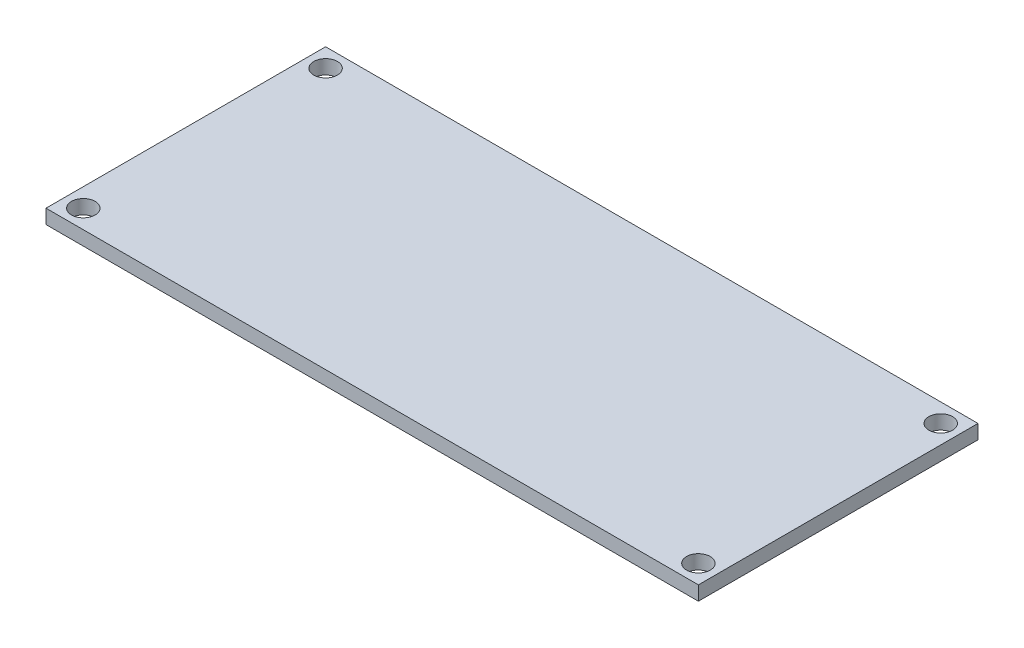
ISO-10303-21;
HEADER;
FILE_DESCRIPTION(('STEP AP214'),'2;1');
FILE_NAME('part.step','',(''),(''),'','','');
FILE_SCHEMA(('AUTOMOTIVE_DESIGN { 1 0 10303 214 1 1 1 1 }'));
ENDSEC;
DATA;
#1=APPLICATION_CONTEXT('core data for automotive mechanical design processes');
#2=APPLICATION_PROTOCOL_DEFINITION('international standard','automotive_design',2000,#1);
#3=PRODUCT_CONTEXT('',#1,'mechanical');
#4=PRODUCT('Part','Part','',(#3));
#5=PRODUCT_RELATED_PRODUCT_CATEGORY('part','',(#4));
#6=PRODUCT_DEFINITION_FORMATION('','',#4);
#7=PRODUCT_DEFINITION_CONTEXT('part definition',#1,'design');
#8=PRODUCT_DEFINITION('design','',#6,#7);
#9=PRODUCT_DEFINITION_SHAPE('','',#8);
#10=(LENGTH_UNIT() NAMED_UNIT(*) SI_UNIT(.MILLI.,.METRE.));
#11=(NAMED_UNIT(*) PLANE_ANGLE_UNIT() SI_UNIT($,.RADIAN.));
#12=(NAMED_UNIT(*) SI_UNIT($,.STERADIAN.) SOLID_ANGLE_UNIT());
#13=UNCERTAINTY_MEASURE_WITH_UNIT(LENGTH_MEASURE(1.E-05),#10,'distance_accuracy_value','');
#14=(GEOMETRIC_REPRESENTATION_CONTEXT(3) GLOBAL_UNCERTAINTY_ASSIGNED_CONTEXT((#13)) GLOBAL_UNIT_ASSIGNED_CONTEXT((#10,
#11,#12)) REPRESENTATION_CONTEXT('',''));
#15=CARTESIAN_POINT('',(0.,0.,0.));
#16=DIRECTION('',(0.,0.,1.));
#17=DIRECTION('',(1.,0.,0.));
#18=AXIS2_PLACEMENT_3D('',#15,#16,#17);
#19=CARTESIAN_POINT('',(-29.452380952381,1.524,-16.3095238095238));
#20=DIRECTION('',(1.,0.,0.));
#21=DIRECTION('',(0.,0.,-1.));
#22=AXIS2_PLACEMENT_3D('',#19,#20,#21);
#23=PLANE('',#22);
#24=DIRECTION('',(0.,0.,1.));
#25=VECTOR('',#24,1.);
#26=CARTESIAN_POINT('',(-29.452380952381,0.,-16.3095238095238));
#27=LINE('',#26,#25);
#28=CARTESIAN_POINT('',(-29.452380952381,0.,-16.3095238095238));
#29=VERTEX_POINT('',#28);
#30=CARTESIAN_POINT('',(-29.452380952381,0.,13.6904761904762));
#31=VERTEX_POINT('',#30);
#32=EDGE_CURVE('E95',#29,#31,#27,.T.);
#33=ORIENTED_EDGE('',*,*,#32,.T.);
#34=DIRECTION('',(0.,-1.,0.));
#35=VECTOR('',#34,1.);
#36=CARTESIAN_POINT('',(-29.452380952381,1.524,13.6904761904762));
#37=LINE('',#36,#35);
#38=CARTESIAN_POINT('',(-29.452380952381,1.524,13.6904761904762));
#39=VERTEX_POINT('',#38);
#40=EDGE_CURVE('E11',#39,#31,#37,.T.);
#41=ORIENTED_EDGE('',*,*,#40,.F.);
#42=DIRECTION('',(0.,0.,1.));
#43=VECTOR('',#42,1.);
#44=CARTESIAN_POINT('',(-29.452380952381,1.524,-16.3095238095238));
#45=LINE('',#44,#43);
#46=CARTESIAN_POINT('',(-29.452380952381,1.524,-16.3095238095238));
#47=VERTEX_POINT('',#46);
#48=EDGE_CURVE('E83',#47,#39,#45,.T.);
#49=ORIENTED_EDGE('',*,*,#48,.F.);
#50=DIRECTION('',(0.,-1.,0.));
#51=VECTOR('',#50,1.);
#52=CARTESIAN_POINT('',(-29.452380952381,1.524,-16.3095238095238));
#53=LINE('',#52,#51);
#54=EDGE_CURVE('E91',#47,#29,#53,.T.);
#55=ORIENTED_EDGE('',*,*,#54,.T.);
#56=EDGE_LOOP('',(#33,#41,#49,#55));
#57=FACE_BOUND('',#56,.T.);
#58=ADVANCED_FACE('F32',(#57),#23,.F.);
#59=CARTESIAN_POINT('',(-29.452380952381,1.524,13.6904761904762));
#60=DIRECTION('',(0.,0.,-1.));
#61=DIRECTION('',(-1.,0.,0.));
#62=AXIS2_PLACEMENT_3D('',#59,#60,#61);
#63=PLANE('',#62);
#64=DIRECTION('',(1.,0.,0.));
#65=VECTOR('',#64,1.);
#66=CARTESIAN_POINT('',(-29.452380952381,0.,13.6904761904762));
#67=LINE('',#66,#65);
#68=CARTESIAN_POINT('',(40.5476190476191,0.,13.6904761904762));
#69=VERTEX_POINT('',#68);
#70=EDGE_CURVE('E87',#31,#69,#67,.T.);
#71=ORIENTED_EDGE('',*,*,#70,.T.);
#72=DIRECTION('',(0.,-1.,0.));
#73=VECTOR('',#72,1.);
#74=CARTESIAN_POINT('',(40.5476190476191,1.524,13.6904761904762));
#75=LINE('',#74,#73);
#76=CARTESIAN_POINT('',(40.5476190476191,1.524,13.6904761904762));
#77=VERTEX_POINT('',#76);
#78=EDGE_CURVE('E40',#77,#69,#75,.T.);
#79=ORIENTED_EDGE('',*,*,#78,.F.);
#80=DIRECTION('',(1.,0.,0.));
#81=VECTOR('',#80,1.);
#82=CARTESIAN_POINT('',(-29.452380952381,1.524,13.6904761904762));
#83=LINE('',#82,#81);
#84=EDGE_CURVE('E78',#39,#77,#83,.T.);
#85=ORIENTED_EDGE('',*,*,#84,.F.);
#86=ORIENTED_EDGE('',*,*,#40,.T.);
#87=EDGE_LOOP('',(#71,#79,#85,#86));
#88=FACE_BOUND('',#87,.T.);
#89=ADVANCED_FACE('F86',(#88),#63,.F.);
#90=CARTESIAN_POINT('',(40.5476190476191,1.524,-16.3095238095238));
#91=DIRECTION('',(-1.,0.,0.));
#92=DIRECTION('',(0.,0.,1.));
#93=AXIS2_PLACEMENT_3D('',#90,#91,#92);
#94=PLANE('',#93);
#95=DIRECTION('',(0.,0.,-1.));
#96=VECTOR('',#95,1.);
#97=CARTESIAN_POINT('',(40.5476190476191,0.,-16.3095238095238));
#98=LINE('',#97,#96);
#99=CARTESIAN_POINT('',(40.5476190476191,0.,-16.3095238095238));
#100=VERTEX_POINT('',#99);
#101=EDGE_CURVE('E65',#69,#100,#98,.T.);
#102=ORIENTED_EDGE('',*,*,#101,.T.);
#103=DIRECTION('',(0.,-1.,0.));
#104=VECTOR('',#103,1.);
#105=CARTESIAN_POINT('',(40.5476190476191,1.524,-16.3095238095238));
#106=LINE('',#105,#104);
#107=CARTESIAN_POINT('',(40.5476190476191,1.524,-16.3095238095238));
#108=VERTEX_POINT('',#107);
#109=EDGE_CURVE('E88',#108,#100,#106,.T.);
#110=ORIENTED_EDGE('',*,*,#109,.F.);
#111=DIRECTION('',(0.,0.,-1.));
#112=VECTOR('',#111,1.);
#113=CARTESIAN_POINT('',(40.5476190476191,1.524,-16.3095238095238));
#114=LINE('',#113,#112);
#115=EDGE_CURVE('E81',#77,#108,#114,.T.);
#116=ORIENTED_EDGE('',*,*,#115,.F.);
#117=ORIENTED_EDGE('',*,*,#78,.T.);
#118=EDGE_LOOP('',(#102,#110,#116,#117));
#119=FACE_BOUND('',#118,.T.);
#120=ADVANCED_FACE('F89',(#119),#94,.F.);
#121=CARTESIAN_POINT('',(-29.452380952381,1.524,-16.3095238095238));
#122=DIRECTION('',(0.,0.,1.));
#123=DIRECTION('',(1.,0.,0.));
#124=AXIS2_PLACEMENT_3D('',#121,#122,#123);
#125=PLANE('',#124);
#126=DIRECTION('',(-1.,0.,0.));
#127=VECTOR('',#126,1.);
#128=CARTESIAN_POINT('',(-29.452380952381,0.,-16.3095238095238));
#129=LINE('',#128,#127);
#130=EDGE_CURVE('E71',#100,#29,#129,.T.);
#131=ORIENTED_EDGE('',*,*,#130,.T.);
#132=ORIENTED_EDGE('',*,*,#54,.F.);
#133=DIRECTION('',(-1.,0.,0.));
#134=VECTOR('',#133,1.);
#135=CARTESIAN_POINT('',(-29.452380952381,1.524,-16.3095238095238));
#136=LINE('',#135,#134);
#137=EDGE_CURVE('E48',#108,#47,#136,.T.);
#138=ORIENTED_EDGE('',*,*,#137,.F.);
#139=ORIENTED_EDGE('',*,*,#109,.T.);
#140=EDGE_LOOP('',(#131,#132,#138,#139));
#141=FACE_BOUND('',#140,.T.);
#142=ADVANCED_FACE('F103',(#141),#125,.F.);
#143=CARTESIAN_POINT('',(0.,1.524,0.));
#144=DIRECTION('',(0.,1.,0.));
#145=DIRECTION('',(0.,0.,1.));
#146=AXIS2_PLACEMENT_3D('',#143,#144,#145);
#147=PLANE('',#146);
#148=CARTESIAN_POINT('',(38.5476190476191,1.524,-14.3095238095238));
#149=DIRECTION('',(0.,1.,0.));
#150=DIRECTION('',(0.,0.,-1.));
#151=AXIS2_PLACEMENT_3D('',#148,#149,#150);
#152=CIRCLE('',#151,1.27);
#153=CARTESIAN_POINT('',(38.5476190476191,1.524,-15.5795238095238));
#154=VERTEX_POINT('',#153);
#155=EDGE_CURVE('E127',#154,#154,#152,.T.);
#156=ORIENTED_EDGE('',*,*,#155,.F.);
#157=EDGE_LOOP('',(#156));
#158=FACE_BOUND('',#157,.T.);
#159=CARTESIAN_POINT('',(-27.4523809523809,1.524,-14.3095238095238));
#160=DIRECTION('',(0.,-1.,0.));
#161=DIRECTION('',(0.,0.,-1.));
#162=AXIS2_PLACEMENT_3D('',#159,#160,#161);
#163=CIRCLE('',#162,1.27);
#164=CARTESIAN_POINT('',(-27.4523809523809,1.524,-15.5795238095238));
#165=VERTEX_POINT('',#164);
#166=EDGE_CURVE('E121',#165,#165,#163,.T.);
#167=ORIENTED_EDGE('',*,*,#166,.T.);
#168=EDGE_LOOP('',(#167));
#169=FACE_BOUND('',#168,.T.);
#170=CARTESIAN_POINT('',(38.5476190476191,1.524,11.6904761904762));
#171=DIRECTION('',(0.,-1.,0.));
#172=DIRECTION('',(0.,0.,1.));
#173=AXIS2_PLACEMENT_3D('',#170,#171,#172);
#174=CIRCLE('',#173,1.27);
#175=CARTESIAN_POINT('',(38.5476190476191,1.524,12.9604761904762));
#176=VERTEX_POINT('',#175);
#177=EDGE_CURVE('E115',#176,#176,#174,.T.);
#178=ORIENTED_EDGE('',*,*,#177,.T.);
#179=EDGE_LOOP('',(#178));
#180=FACE_BOUND('',#179,.T.);
#181=CARTESIAN_POINT('',(-27.4523809523809,1.524,11.6904761904762));
#182=DIRECTION('',(0.,1.,0.));
#183=DIRECTION('',(0.,0.,1.));
#184=AXIS2_PLACEMENT_3D('',#181,#182,#183);
#185=CIRCLE('',#184,1.27);
#186=CARTESIAN_POINT('',(-27.4523809523809,1.524,12.9604761904762));
#187=VERTEX_POINT('',#186);
#188=EDGE_CURVE('E109',#187,#187,#185,.T.);
#189=ORIENTED_EDGE('',*,*,#188,.F.);
#190=EDGE_LOOP('',(#189));
#191=FACE_BOUND('',#190,.T.);
#192=ORIENTED_EDGE('',*,*,#48,.T.);
#193=ORIENTED_EDGE('',*,*,#84,.T.);
#194=ORIENTED_EDGE('',*,*,#115,.T.);
#195=ORIENTED_EDGE('',*,*,#137,.T.);
#196=EDGE_LOOP('',(#192,#193,#194,#195));
#197=FACE_BOUND('',#196,.T.);
#198=ADVANCED_FACE('F79',(#158,#169,#180,#191,#197),#147,.T.);
#199=CARTESIAN_POINT('',(0.,0.,0.));
#200=DIRECTION('',(0.,1.,0.));
#201=DIRECTION('',(0.,0.,1.));
#202=AXIS2_PLACEMENT_3D('',#199,#200,#201);
#203=PLANE('',#202);
#204=CARTESIAN_POINT('',(38.5476190476191,0.,-14.3095238095238));
#205=DIRECTION('',(0.,1.,0.));
#206=DIRECTION('',(0.,0.,-1.));
#207=AXIS2_PLACEMENT_3D('',#204,#205,#206);
#208=CIRCLE('',#207,1.27);
#209=CARTESIAN_POINT('',(38.5476190476191,0.,-15.5795238095238));
#210=VERTEX_POINT('',#209);
#211=EDGE_CURVE('E124',#210,#210,#208,.T.);
#212=ORIENTED_EDGE('',*,*,#211,.T.);
#213=EDGE_LOOP('',(#212));
#214=FACE_BOUND('',#213,.T.);
#215=CARTESIAN_POINT('',(-27.4523809523809,0.,-14.3095238095238));
#216=DIRECTION('',(0.,-1.,0.));
#217=DIRECTION('',(0.,0.,-1.));
#218=AXIS2_PLACEMENT_3D('',#215,#216,#217);
#219=CIRCLE('',#218,1.27);
#220=CARTESIAN_POINT('',(-27.4523809523809,0.,-15.5795238095238));
#221=VERTEX_POINT('',#220);
#222=EDGE_CURVE('E118',#221,#221,#219,.T.);
#223=ORIENTED_EDGE('',*,*,#222,.F.);
#224=EDGE_LOOP('',(#223));
#225=FACE_BOUND('',#224,.T.);
#226=CARTESIAN_POINT('',(38.5476190476191,0.,11.6904761904762));
#227=DIRECTION('',(0.,-1.,0.));
#228=DIRECTION('',(0.,0.,1.));
#229=AXIS2_PLACEMENT_3D('',#226,#227,#228);
#230=CIRCLE('',#229,1.27);
#231=CARTESIAN_POINT('',(38.5476190476191,0.,12.9604761904762));
#232=VERTEX_POINT('',#231);
#233=EDGE_CURVE('E112',#232,#232,#230,.T.);
#234=ORIENTED_EDGE('',*,*,#233,.F.);
#235=EDGE_LOOP('',(#234));
#236=FACE_BOUND('',#235,.T.);
#237=CARTESIAN_POINT('',(-27.4523809523809,0.,11.6904761904762));
#238=DIRECTION('',(0.,1.,0.));
#239=DIRECTION('',(0.,0.,1.));
#240=AXIS2_PLACEMENT_3D('',#237,#238,#239);
#241=CIRCLE('',#240,1.27);
#242=CARTESIAN_POINT('',(-27.4523809523809,0.,12.9604761904762));
#243=VERTEX_POINT('',#242);
#244=EDGE_CURVE('E98',#243,#243,#241,.T.);
#245=ORIENTED_EDGE('',*,*,#244,.T.);
#246=EDGE_LOOP('',(#245));
#247=FACE_BOUND('',#246,.T.);
#248=ORIENTED_EDGE('',*,*,#32,.F.);
#249=ORIENTED_EDGE('',*,*,#130,.F.);
#250=ORIENTED_EDGE('',*,*,#101,.F.);
#251=ORIENTED_EDGE('',*,*,#70,.F.);
#252=EDGE_LOOP('',(#248,#249,#250,#251));
#253=FACE_BOUND('',#252,.T.);
#254=ADVANCED_FACE('F106',(#214,#225,#236,#247,#253),#203,.F.);
#255=CARTESIAN_POINT('',(-27.4523809523809,0.,11.6904761904762));
#256=DIRECTION('',(0.,1.,0.));
#257=DIRECTION('',(0.,0.,1.));
#258=AXIS2_PLACEMENT_3D('',#255,#256,#257);
#259=CYLINDRICAL_SURFACE('',#258,1.27);
#260=ORIENTED_EDGE('',*,*,#244,.F.);
#261=EDGE_LOOP('',(#260));
#262=FACE_BOUND('',#261,.T.);
#263=ORIENTED_EDGE('',*,*,#188,.T.);
#264=EDGE_LOOP('',(#263));
#265=FACE_BOUND('',#264,.T.);
#266=ADVANCED_FACE('F151',(#262,#265),#259,.F.);
#267=CARTESIAN_POINT('',(38.5476190476191,0.,11.6904761904762));
#268=DIRECTION('',(0.,1.,0.));
#269=DIRECTION('',(0.,0.,1.));
#270=AXIS2_PLACEMENT_3D('',#267,#268,#269);
#271=CYLINDRICAL_SURFACE('',#270,1.27);
#272=ORIENTED_EDGE('',*,*,#233,.T.);
#273=EDGE_LOOP('',(#272));
#274=FACE_BOUND('',#273,.T.);
#275=ORIENTED_EDGE('',*,*,#177,.F.);
#276=EDGE_LOOP('',(#275));
#277=FACE_BOUND('',#276,.T.);
#278=ADVANCED_FACE('F153',(#274,#277),#271,.F.);
#279=CARTESIAN_POINT('',(-27.4523809523809,0.,-14.3095238095238));
#280=DIRECTION('',(0.,1.,0.));
#281=DIRECTION('',(0.,0.,1.));
#282=AXIS2_PLACEMENT_3D('',#279,#280,#281);
#283=CYLINDRICAL_SURFACE('',#282,1.27);
#284=ORIENTED_EDGE('',*,*,#222,.T.);
#285=EDGE_LOOP('',(#284));
#286=FACE_BOUND('',#285,.T.);
#287=ORIENTED_EDGE('',*,*,#166,.F.);
#288=EDGE_LOOP('',(#287));
#289=FACE_BOUND('',#288,.T.);
#290=ADVANCED_FACE('F138',(#286,#289),#283,.F.);
#291=CARTESIAN_POINT('',(38.5476190476191,0.,-14.3095238095238));
#292=DIRECTION('',(0.,1.,0.));
#293=DIRECTION('',(0.,0.,1.));
#294=AXIS2_PLACEMENT_3D('',#291,#292,#293);
#295=CYLINDRICAL_SURFACE('',#294,1.27);
#296=ORIENTED_EDGE('',*,*,#211,.F.);
#297=EDGE_LOOP('',(#296));
#298=FACE_BOUND('',#297,.T.);
#299=ORIENTED_EDGE('',*,*,#155,.T.);
#300=EDGE_LOOP('',(#299));
#301=FACE_BOUND('',#300,.T.);
#302=ADVANCED_FACE('F135',(#298,#301),#295,.F.);
#303=CLOSED_SHELL('',(#58,#89,#120,#142,#198,#254,#266,#278,#290,#302));
#304=MANIFOLD_SOLID_BREP('B2',#303);
#305=ADVANCED_BREP_SHAPE_REPRESENTATION('',(#18,#304),#14);
#306=SHAPE_DEFINITION_REPRESENTATION(#9,#305);
ENDSEC;
END-ISO-10303-21;
